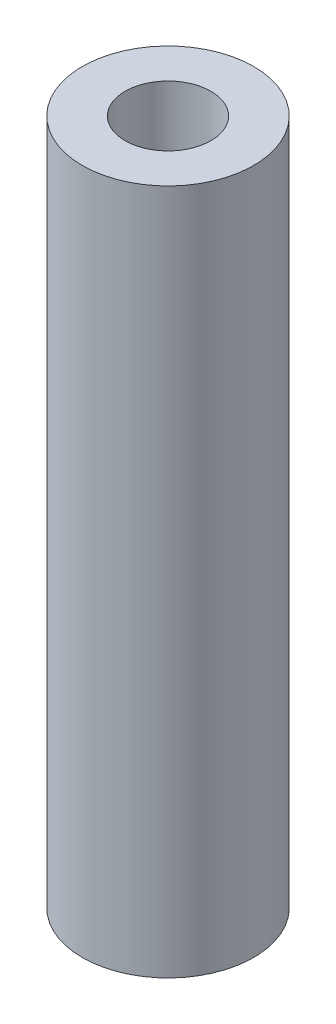
ISO-10303-21;
HEADER;
FILE_DESCRIPTION(('STEP AP214'),'2;1');
FILE_NAME('part.step','',(''),(''),'','','');
FILE_SCHEMA(('AUTOMOTIVE_DESIGN { 1 0 10303 214 1 1 1 1 }'));
ENDSEC;
DATA;
#1=APPLICATION_CONTEXT('core data for automotive mechanical design processes');
#2=APPLICATION_PROTOCOL_DEFINITION('international standard','automotive_design',2000,#1);
#3=PRODUCT_CONTEXT('',#1,'mechanical');
#4=PRODUCT('Part','Part','',(#3));
#5=PRODUCT_RELATED_PRODUCT_CATEGORY('part','',(#4));
#6=PRODUCT_DEFINITION_FORMATION('','',#4);
#7=PRODUCT_DEFINITION_CONTEXT('part definition',#1,'design');
#8=PRODUCT_DEFINITION('design','',#6,#7);
#9=PRODUCT_DEFINITION_SHAPE('','',#8);
#10=(LENGTH_UNIT() NAMED_UNIT(*) SI_UNIT(.MILLI.,.METRE.));
#11=(NAMED_UNIT(*) PLANE_ANGLE_UNIT() SI_UNIT($,.RADIAN.));
#12=(NAMED_UNIT(*) SI_UNIT($,.STERADIAN.) SOLID_ANGLE_UNIT());
#13=UNCERTAINTY_MEASURE_WITH_UNIT(LENGTH_MEASURE(1.E-05),#10,'distance_accuracy_value','');
#14=(GEOMETRIC_REPRESENTATION_CONTEXT(3) GLOBAL_UNCERTAINTY_ASSIGNED_CONTEXT((#13)) GLOBAL_UNIT_ASSIGNED_CONTEXT((#10,
#11,#12)) REPRESENTATION_CONTEXT('',''));
#15=CARTESIAN_POINT('',(0.,0.,0.));
#16=DIRECTION('',(0.,0.,1.));
#17=DIRECTION('',(1.,0.,0.));
#18=AXIS2_PLACEMENT_3D('',#15,#16,#17);
#19=CARTESIAN_POINT('',(0.,304.8,0.));
#20=DIRECTION('',(0.,1.,0.));
#21=DIRECTION('',(0.,0.,1.));
#22=AXIS2_PLACEMENT_3D('',#19,#20,#21);
#23=PLANE('',#22);
#24=CARTESIAN_POINT('',(0.,304.8,0.));
#25=DIRECTION('',(0.,1.,0.));
#26=DIRECTION('',(0.,0.,1.));
#27=AXIS2_PLACEMENT_3D('',#24,#25,#26);
#28=CIRCLE('',#27,38.1);
#29=CARTESIAN_POINT('',(0.,304.8,38.1));
#30=VERTEX_POINT('',#29);
#31=EDGE_CURVE('E10',#30,#30,#28,.T.);
#32=ORIENTED_EDGE('',*,*,#31,.T.);
#33=EDGE_LOOP('',(#32));
#34=FACE_BOUND('',#33,.T.);
#35=CARTESIAN_POINT('',(0.,304.8,0.));
#36=DIRECTION('',(0.,1.,0.));
#37=DIRECTION('',(0.,0.,1.));
#38=AXIS2_PLACEMENT_3D('',#35,#36,#37);
#39=CIRCLE('',#38,19.05);
#40=CARTESIAN_POINT('',(0.,304.8,19.05));
#41=VERTEX_POINT('',#40);
#42=EDGE_CURVE('E41',#41,#41,#39,.T.);
#43=ORIENTED_EDGE('',*,*,#42,.F.);
#44=EDGE_LOOP('',(#43));
#45=FACE_BOUND('',#44,.T.);
#46=ADVANCED_FACE('F30',(#34,#45),#23,.T.);
#47=CARTESIAN_POINT('',(0.,0.,0.));
#48=DIRECTION('',(0.,1.,0.));
#49=DIRECTION('',(0.,0.,1.));
#50=AXIS2_PLACEMENT_3D('',#47,#48,#49);
#51=PLANE('',#50);
#52=CARTESIAN_POINT('',(0.,0.,0.));
#53=DIRECTION('',(0.,1.,0.));
#54=DIRECTION('',(0.,0.,1.));
#55=AXIS2_PLACEMENT_3D('',#52,#53,#54);
#56=CIRCLE('',#55,38.1);
#57=CARTESIAN_POINT('',(0.,0.,38.1));
#58=VERTEX_POINT('',#57);
#59=EDGE_CURVE('E34',#58,#58,#56,.T.);
#60=ORIENTED_EDGE('',*,*,#59,.F.);
#61=EDGE_LOOP('',(#60));
#62=FACE_BOUND('',#61,.T.);
#63=CARTESIAN_POINT('',(0.,0.,0.));
#64=DIRECTION('',(0.,1.,0.));
#65=DIRECTION('',(0.,0.,1.));
#66=AXIS2_PLACEMENT_3D('',#63,#64,#65);
#67=CIRCLE('',#66,19.05);
#68=CARTESIAN_POINT('',(0.,0.,19.05));
#69=VERTEX_POINT('',#68);
#70=EDGE_CURVE('E43',#69,#69,#67,.T.);
#71=ORIENTED_EDGE('',*,*,#70,.T.);
#72=EDGE_LOOP('',(#71));
#73=FACE_BOUND('',#72,.T.);
#74=ADVANCED_FACE('F53',(#62,#73),#51,.F.);
#75=CARTESIAN_POINT('',(0.,304.8,0.));
#76=DIRECTION('',(0.,-1.,0.));
#77=DIRECTION('',(0.,0.,-1.));
#78=AXIS2_PLACEMENT_3D('',#75,#76,#77);
#79=CYLINDRICAL_SURFACE('',#78,38.1);
#80=ORIENTED_EDGE('',*,*,#31,.F.);
#81=EDGE_LOOP('',(#80));
#82=FACE_BOUND('',#81,.T.);
#83=ORIENTED_EDGE('',*,*,#59,.T.);
#84=EDGE_LOOP('',(#83));
#85=FACE_BOUND('',#84,.T.);
#86=ADVANCED_FACE('F32',(#82,#85),#79,.T.);
#87=CARTESIAN_POINT('',(0.,304.8,0.));
#88=DIRECTION('',(0.,-1.,0.));
#89=DIRECTION('',(0.,0.,-1.));
#90=AXIS2_PLACEMENT_3D('',#87,#88,#89);
#91=CYLINDRICAL_SURFACE('',#90,19.05);
#92=ORIENTED_EDGE('',*,*,#42,.T.);
#93=EDGE_LOOP('',(#92));
#94=FACE_BOUND('',#93,.T.);
#95=ORIENTED_EDGE('',*,*,#70,.F.);
#96=EDGE_LOOP('',(#95));
#97=FACE_BOUND('',#96,.T.);
#98=ADVANCED_FACE('F49',(#94,#97),#91,.F.);
#99=CLOSED_SHELL('',(#46,#74,#86,#98));
#100=MANIFOLD_SOLID_BREP('B2',#99);
#101=ADVANCED_BREP_SHAPE_REPRESENTATION('',(#18,#100),#14);
#102=SHAPE_DEFINITION_REPRESENTATION(#9,#101);
ENDSEC;
END-ISO-10303-21;
